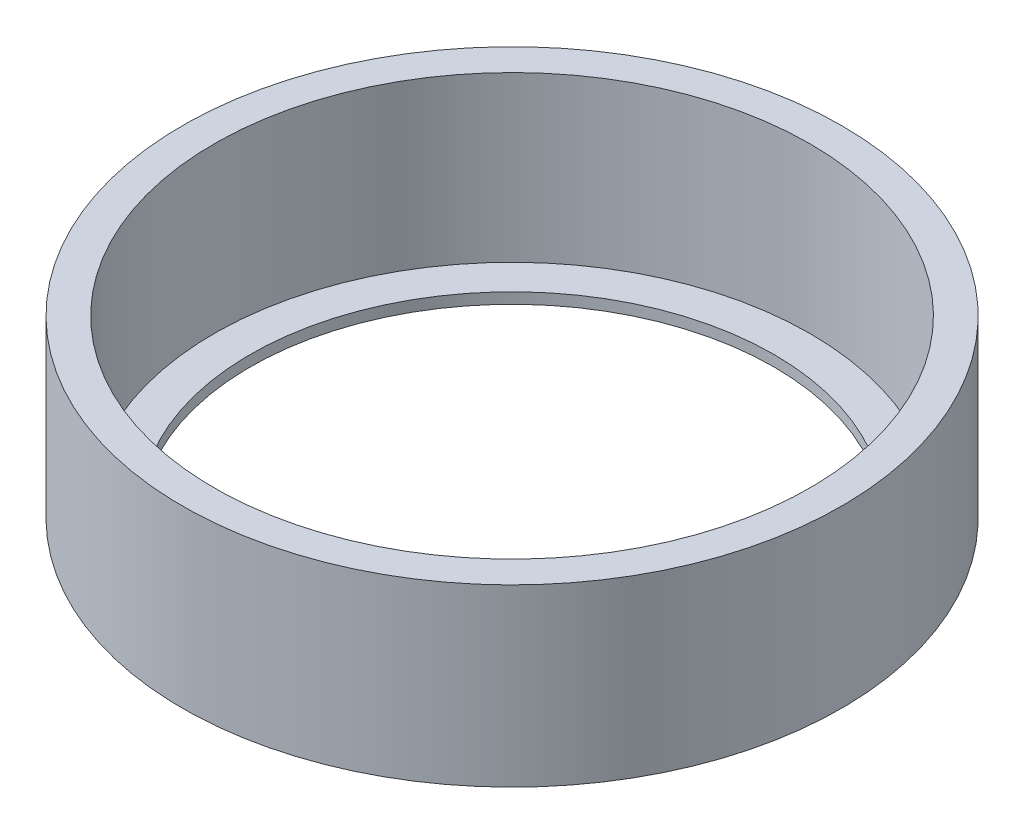
ISO-10303-21;
HEADER;
FILE_DESCRIPTION(('STEP AP214'),'2;1');
FILE_NAME('part.step','',(''),(''),'','','');
FILE_SCHEMA(('AUTOMOTIVE_DESIGN { 1 0 10303 214 1 1 1 1 }'));
ENDSEC;
DATA;
#1=APPLICATION_CONTEXT('core data for automotive mechanical design processes');
#2=APPLICATION_PROTOCOL_DEFINITION('international standard','automotive_design',2000,#1);
#3=PRODUCT_CONTEXT('',#1,'mechanical');
#4=PRODUCT('Part','Part','',(#3));
#5=PRODUCT_RELATED_PRODUCT_CATEGORY('part','',(#4));
#6=PRODUCT_DEFINITION_FORMATION('','',#4);
#7=PRODUCT_DEFINITION_CONTEXT('part definition',#1,'design');
#8=PRODUCT_DEFINITION('design','',#6,#7);
#9=PRODUCT_DEFINITION_SHAPE('','',#8);
#10=(LENGTH_UNIT() NAMED_UNIT(*) SI_UNIT(.MILLI.,.METRE.));
#11=(NAMED_UNIT(*) PLANE_ANGLE_UNIT() SI_UNIT($,.RADIAN.));
#12=(NAMED_UNIT(*) SI_UNIT($,.STERADIAN.) SOLID_ANGLE_UNIT());
#13=UNCERTAINTY_MEASURE_WITH_UNIT(LENGTH_MEASURE(1.E-05),#10,'distance_accuracy_value','');
#14=(GEOMETRIC_REPRESENTATION_CONTEXT(3) GLOBAL_UNCERTAINTY_ASSIGNED_CONTEXT((#13)) GLOBAL_UNIT_ASSIGNED_CONTEXT((#10,
#11,#12)) REPRESENTATION_CONTEXT('',''));
#15=CARTESIAN_POINT('',(0.,0.,0.));
#16=DIRECTION('',(0.,0.,1.));
#17=DIRECTION('',(1.,0.,0.));
#18=AXIS2_PLACEMENT_3D('',#15,#16,#17);
#19=CARTESIAN_POINT('',(36.83,0.,0.));
#20=DIRECTION('',(0.,-1.,0.));
#21=DIRECTION('',(0.,0.,-1.));
#22=AXIS2_PLACEMENT_3D('',#19,#20,#21);
#23=PLANE('',#22);
#24=CARTESIAN_POINT('',(0.,0.,0.));
#25=DIRECTION('',(0.,-1.,0.));
#26=DIRECTION('',(0.,0.,-1.));
#27=AXIS2_PLACEMENT_3D('',#24,#25,#26);
#28=CIRCLE('',#27,46.355);
#29=CARTESIAN_POINT('',(0.,0.,-46.355));
#30=VERTEX_POINT('',#29);
#31=EDGE_CURVE('E10',#30,#30,#28,.T.);
#32=ORIENTED_EDGE('',*,*,#31,.T.);
#33=EDGE_LOOP('',(#32));
#34=FACE_BOUND('',#33,.T.);
#35=CARTESIAN_POINT('',(0.,0.,0.));
#36=DIRECTION('',(0.,-1.,0.));
#37=DIRECTION('',(0.,0.,-1.));
#38=AXIS2_PLACEMENT_3D('',#35,#36,#37);
#39=CIRCLE('',#38,36.83);
#40=CARTESIAN_POINT('',(0.,0.,-36.83));
#41=VERTEX_POINT('',#40);
#42=EDGE_CURVE('E59',#41,#41,#39,.T.);
#43=ORIENTED_EDGE('',*,*,#42,.F.);
#44=EDGE_LOOP('',(#43));
#45=FACE_BOUND('',#44,.T.);
#46=ADVANCED_FACE('F37',(#34,#45),#23,.T.);
#47=CARTESIAN_POINT('',(0.,0.,0.));
#48=DIRECTION('',(0.,-1.,0.));
#49=DIRECTION('',(0.,0.,-1.));
#50=AXIS2_PLACEMENT_3D('',#47,#48,#49);
#51=CYLINDRICAL_SURFACE('',#50,46.355);
#52=CARTESIAN_POINT('',(0.,24.638,0.));
#53=DIRECTION('',(0.,-1.,0.));
#54=DIRECTION('',(0.,0.,-1.));
#55=AXIS2_PLACEMENT_3D('',#52,#53,#54);
#56=CIRCLE('',#55,46.355);
#57=CARTESIAN_POINT('',(0.,24.638,-46.355));
#58=VERTEX_POINT('',#57);
#59=EDGE_CURVE('E43',#58,#58,#56,.T.);
#60=ORIENTED_EDGE('',*,*,#59,.T.);
#61=EDGE_LOOP('',(#60));
#62=FACE_BOUND('',#61,.T.);
#63=ORIENTED_EDGE('',*,*,#31,.F.);
#64=EDGE_LOOP('',(#63));
#65=FACE_BOUND('',#64,.T.);
#66=ADVANCED_FACE('F67',(#62,#65),#51,.T.);
#67=CARTESIAN_POINT('',(46.355,24.638,0.));
#68=DIRECTION('',(0.,1.,0.));
#69=DIRECTION('',(0.,0.,1.));
#70=AXIS2_PLACEMENT_3D('',#67,#68,#69);
#71=PLANE('',#70);
#72=CARTESIAN_POINT('',(0.,24.638,0.));
#73=DIRECTION('',(0.,-1.,0.));
#74=DIRECTION('',(0.,0.,-1.));
#75=AXIS2_PLACEMENT_3D('',#72,#73,#74);
#76=CIRCLE('',#75,41.91);
#77=CARTESIAN_POINT('',(0.,24.638,-41.91));
#78=VERTEX_POINT('',#77);
#79=EDGE_CURVE('E47',#78,#78,#76,.T.);
#80=ORIENTED_EDGE('',*,*,#79,.T.);
#81=EDGE_LOOP('',(#80));
#82=FACE_BOUND('',#81,.T.);
#83=ORIENTED_EDGE('',*,*,#59,.F.);
#84=EDGE_LOOP('',(#83));
#85=FACE_BOUND('',#84,.T.);
#86=ADVANCED_FACE('F71',(#82,#85),#71,.T.);
#87=CARTESIAN_POINT('',(0.,0.,0.));
#88=DIRECTION('',(0.,-1.,0.));
#89=DIRECTION('',(0.,0.,-1.));
#90=AXIS2_PLACEMENT_3D('',#87,#88,#89);
#91=CYLINDRICAL_SURFACE('',#90,41.91);
#92=CARTESIAN_POINT('',(0.,1.524,0.));
#93=DIRECTION('',(0.,-1.,0.));
#94=DIRECTION('',(0.,0.,-1.));
#95=AXIS2_PLACEMENT_3D('',#92,#93,#94);
#96=CIRCLE('',#95,41.91);
#97=CARTESIAN_POINT('',(0.,1.524,-41.91));
#98=VERTEX_POINT('',#97);
#99=EDGE_CURVE('E51',#98,#98,#96,.T.);
#100=ORIENTED_EDGE('',*,*,#99,.T.);
#101=EDGE_LOOP('',(#100));
#102=FACE_BOUND('',#101,.T.);
#103=ORIENTED_EDGE('',*,*,#79,.F.);
#104=EDGE_LOOP('',(#103));
#105=FACE_BOUND('',#104,.T.);
#106=ADVANCED_FACE('F75',(#102,#105),#91,.F.);
#107=CARTESIAN_POINT('',(41.91,1.524,0.));
#108=DIRECTION('',(0.,1.,0.));
#109=DIRECTION('',(0.,0.,1.));
#110=AXIS2_PLACEMENT_3D('',#107,#108,#109);
#111=PLANE('',#110);
#112=CARTESIAN_POINT('',(0.,1.524,0.));
#113=DIRECTION('',(0.,-1.,0.));
#114=DIRECTION('',(0.,0.,-1.));
#115=AXIS2_PLACEMENT_3D('',#112,#113,#114);
#116=CIRCLE('',#115,36.83);
#117=CARTESIAN_POINT('',(0.,1.524,-36.83));
#118=VERTEX_POINT('',#117);
#119=EDGE_CURVE('E56',#118,#118,#116,.T.);
#120=ORIENTED_EDGE('',*,*,#119,.T.);
#121=EDGE_LOOP('',(#120));
#122=FACE_BOUND('',#121,.T.);
#123=ORIENTED_EDGE('',*,*,#99,.F.);
#124=EDGE_LOOP('',(#123));
#125=FACE_BOUND('',#124,.T.);
#126=ADVANCED_FACE('F82',(#122,#125),#111,.T.);
#127=CARTESIAN_POINT('',(0.,0.,0.));
#128=DIRECTION('',(0.,-1.,0.));
#129=DIRECTION('',(0.,0.,-1.));
#130=AXIS2_PLACEMENT_3D('',#127,#128,#129);
#131=CYLINDRICAL_SURFACE('',#130,36.83);
#132=ORIENTED_EDGE('',*,*,#42,.T.);
#133=EDGE_LOOP('',(#132));
#134=FACE_BOUND('',#133,.T.);
#135=ORIENTED_EDGE('',*,*,#119,.F.);
#136=EDGE_LOOP('',(#135));
#137=FACE_BOUND('',#136,.T.);
#138=ADVANCED_FACE('F63',(#134,#137),#131,.F.);
#139=CLOSED_SHELL('',(#46,#66,#86,#106,#126,#138));
#140=MANIFOLD_SOLID_BREP('B2',#139);
#141=ADVANCED_BREP_SHAPE_REPRESENTATION('',(#18,#140),#14);
#142=SHAPE_DEFINITION_REPRESENTATION(#9,#141);
ENDSEC;
END-ISO-10303-21;
